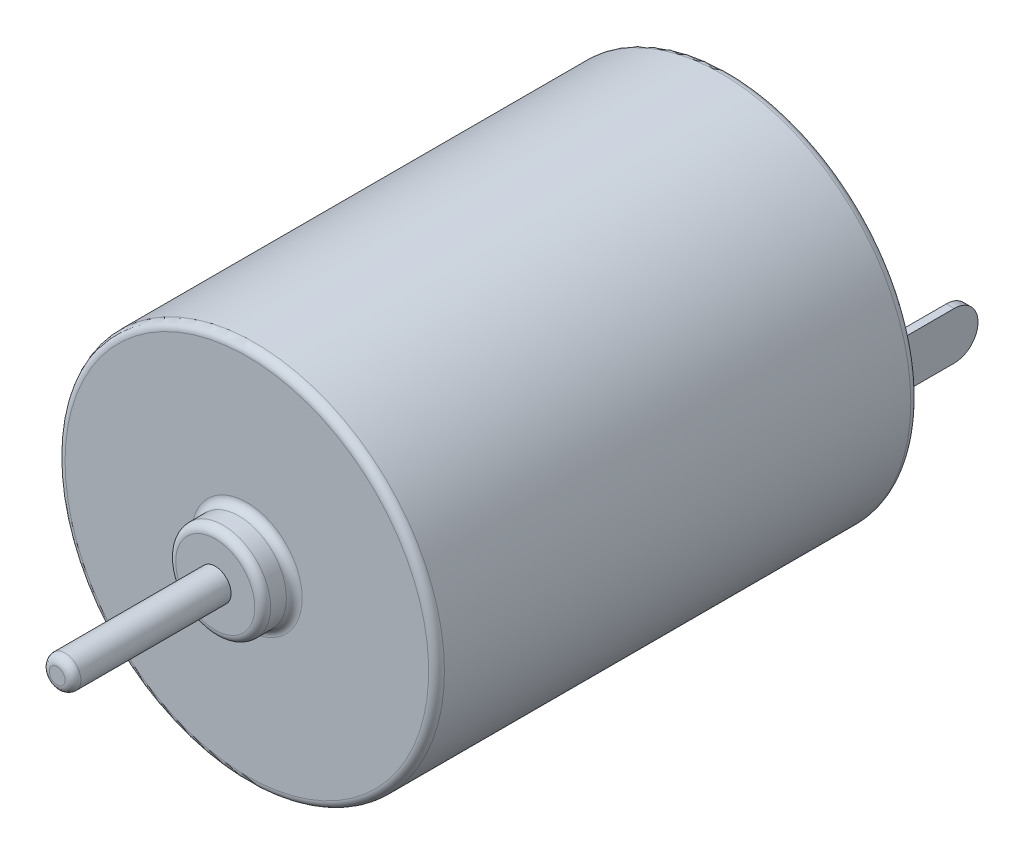
ISO-10303-21;
HEADER;
FILE_DESCRIPTION(('STEP AP214'),'2;1');
FILE_NAME('part.step','',(''),(''),'','','');
FILE_SCHEMA(('AUTOMOTIVE_DESIGN { 1 0 10303 214 1 1 1 1 }'));
ENDSEC;
DATA;
#1=APPLICATION_CONTEXT('core data for automotive mechanical design processes');
#2=APPLICATION_PROTOCOL_DEFINITION('international standard','automotive_design',2000,#1);
#3=PRODUCT_CONTEXT('',#1,'mechanical');
#4=PRODUCT('Part','Part','',(#3));
#5=PRODUCT_RELATED_PRODUCT_CATEGORY('part','',(#4));
#6=PRODUCT_DEFINITION_FORMATION('','',#4);
#7=PRODUCT_DEFINITION_CONTEXT('part definition',#1,'design');
#8=PRODUCT_DEFINITION('design','',#6,#7);
#9=PRODUCT_DEFINITION_SHAPE('','',#8);
#10=(LENGTH_UNIT() NAMED_UNIT(*) SI_UNIT(.MILLI.,.METRE.));
#11=(NAMED_UNIT(*) PLANE_ANGLE_UNIT() SI_UNIT($,.RADIAN.));
#12=(NAMED_UNIT(*) SI_UNIT($,.STERADIAN.) SOLID_ANGLE_UNIT());
#13=UNCERTAINTY_MEASURE_WITH_UNIT(LENGTH_MEASURE(1.E-05),#10,'distance_accuracy_value','');
#14=(GEOMETRIC_REPRESENTATION_CONTEXT(3) GLOBAL_UNCERTAINTY_ASSIGNED_CONTEXT((#13)) GLOBAL_UNIT_ASSIGNED_CONTEXT((#10,
#11,#12)) REPRESENTATION_CONTEXT('',''));
#15=CARTESIAN_POINT('',(0.,0.,0.));
#16=DIRECTION('',(0.,0.,1.));
#17=DIRECTION('',(1.,0.,0.));
#18=AXIS2_PLACEMENT_3D('',#15,#16,#17);
#19=CARTESIAN_POINT('',(9.75,-1.5,0.));
#20=DIRECTION('',(0.,-1.,0.));
#21=DIRECTION('',(0.,0.,-1.));
#22=AXIS2_PLACEMENT_3D('',#19,#20,#21);
#23=PLANE('',#22);
#24=DIRECTION('',(1.,0.,0.));
#25=VECTOR('',#24,1.);
#26=CARTESIAN_POINT('',(4.875,-1.5,-0.5));
#27=LINE('',#26,#25);
#28=CARTESIAN_POINT('',(9.25,-1.5,-0.5));
#29=VERTEX_POINT('',#28);
#30=CARTESIAN_POINT('',(9.75,-1.5,-0.5));
#31=VERTEX_POINT('',#30);
#32=EDGE_CURVE('E337',#29,#31,#27,.T.);
#33=ORIENTED_EDGE('',*,*,#32,.F.);
#34=DIRECTION('',(0.,0.,-1.));
#35=VECTOR('',#34,1.);
#36=CARTESIAN_POINT('',(9.25,-1.5,0.));
#37=LINE('',#36,#35);
#38=CARTESIAN_POINT('',(9.25,-1.5,-4.5));
#39=VERTEX_POINT('',#38);
#40=EDGE_CURVE('E11',#29,#39,#37,.T.);
#41=ORIENTED_EDGE('',*,*,#40,.T.);
#42=DIRECTION('',(-1.,0.,0.));
#43=VECTOR('',#42,1.);
#44=CARTESIAN_POINT('',(9.625,-1.5,-4.5));
#45=LINE('',#44,#43);
#46=CARTESIAN_POINT('',(9.75,-1.5,-4.5));
#47=VERTEX_POINT('',#46);
#48=EDGE_CURVE('E324',#47,#39,#45,.T.);
#49=ORIENTED_EDGE('',*,*,#48,.F.);
#50=DIRECTION('',(0.,0.,-1.));
#51=VECTOR('',#50,1.);
#52=CARTESIAN_POINT('',(9.75,-1.5,0.));
#53=LINE('',#52,#51);
#54=EDGE_CURVE('E238',#31,#47,#53,.T.);
#55=ORIENTED_EDGE('',*,*,#54,.F.);
#56=EDGE_LOOP('',(#33,#41,#49,#55));
#57=FACE_BOUND('',#56,.T.);
#58=ADVANCED_FACE('F17',(#57),#23,.T.);
#59=CARTESIAN_POINT('',(9.25,-1.5,0.));
#60=DIRECTION('',(-1.,0.,0.));
#61=DIRECTION('',(0.,0.,1.));
#62=AXIS2_PLACEMENT_3D('',#59,#60,#61);
#63=PLANE('',#62);
#64=DIRECTION('',(0.,-1.,0.));
#65=VECTOR('',#64,1.);
#66=CARTESIAN_POINT('',(9.25,-0.75,-0.5));
#67=LINE('',#66,#65);
#68=CARTESIAN_POINT('',(9.25,1.5,-0.5));
#69=VERTEX_POINT('',#68);
#70=EDGE_CURVE('E312',#69,#29,#67,.T.);
#71=ORIENTED_EDGE('',*,*,#70,.F.);
#72=DIRECTION('',(0.,0.,-1.));
#73=VECTOR('',#72,1.);
#74=CARTESIAN_POINT('',(9.25,1.5,0.));
#75=LINE('',#74,#73);
#76=CARTESIAN_POINT('',(9.25,1.5,-4.5));
#77=VERTEX_POINT('',#76);
#78=EDGE_CURVE('E251',#69,#77,#75,.T.);
#79=ORIENTED_EDGE('',*,*,#78,.T.);
#80=CARTESIAN_POINT('',(9.25,0.,-4.5));
#81=DIRECTION('',(1.,0.,0.));
#82=DIRECTION('',(0.,0.707106781186547,-0.707106781186548));
#83=AXIS2_PLACEMENT_3D('',#80,#81,#82);
#84=CIRCLE('',#83,1.5);
#85=EDGE_CURVE('E28',#39,#77,#84,.T.);
#86=ORIENTED_EDGE('',*,*,#85,.F.);
#87=ORIENTED_EDGE('',*,*,#40,.F.);
#88=EDGE_LOOP('',(#71,#79,#86,#87));
#89=FACE_BOUND('',#88,.T.);
#90=ADVANCED_FACE('F539',(#89),#63,.T.);
#91=CARTESIAN_POINT('',(-9.25,-1.5,0.));
#92=DIRECTION('',(0.,-1.,0.));
#93=DIRECTION('',(0.,0.,-1.));
#94=AXIS2_PLACEMENT_3D('',#91,#92,#93);
#95=PLANE('',#94);
#96=DIRECTION('',(1.,0.,0.));
#97=VECTOR('',#96,1.);
#98=CARTESIAN_POINT('',(-4.625,-1.5,-0.5));
#99=LINE('',#98,#97);
#100=CARTESIAN_POINT('',(-9.75,-1.5,-0.5));
#101=VERTEX_POINT('',#100);
#102=CARTESIAN_POINT('',(-9.25,-1.5,-0.5));
#103=VERTEX_POINT('',#102);
#104=EDGE_CURVE('E273',#101,#103,#99,.T.);
#105=ORIENTED_EDGE('',*,*,#104,.F.);
#106=DIRECTION('',(0.,0.,-1.));
#107=VECTOR('',#106,1.);
#108=CARTESIAN_POINT('',(-9.75,-1.5,0.));
#109=LINE('',#108,#107);
#110=CARTESIAN_POINT('',(-9.75,-1.5,-4.5));
#111=VERTEX_POINT('',#110);
#112=EDGE_CURVE('E363',#101,#111,#109,.T.);
#113=ORIENTED_EDGE('',*,*,#112,.T.);
#114=DIRECTION('',(-1.,0.,0.));
#115=VECTOR('',#114,1.);
#116=CARTESIAN_POINT('',(-9.375,-1.5,-4.5));
#117=LINE('',#116,#115);
#118=CARTESIAN_POINT('',(-9.25,-1.5,-4.5));
#119=VERTEX_POINT('',#118);
#120=EDGE_CURVE('E427',#119,#111,#117,.T.);
#121=ORIENTED_EDGE('',*,*,#120,.F.);
#122=DIRECTION('',(0.,0.,-1.));
#123=VECTOR('',#122,1.);
#124=CARTESIAN_POINT('',(-9.25,-1.5,0.));
#125=LINE('',#124,#123);
#126=EDGE_CURVE('E268',#103,#119,#125,.T.);
#127=ORIENTED_EDGE('',*,*,#126,.F.);
#128=EDGE_LOOP('',(#105,#113,#121,#127));
#129=FACE_BOUND('',#128,.T.);
#130=ADVANCED_FACE('F479',(#129),#95,.T.);
#131=CARTESIAN_POINT('',(9.375,0.,-4.5));
#132=DIRECTION('',(1.,0.,0.));
#133=DIRECTION('',(0.,0.707106781186547,-0.707106781186548));
#134=AXIS2_PLACEMENT_3D('',#131,#132,#133);
#135=CYLINDRICAL_SURFACE('',#134,1.5);
#136=CARTESIAN_POINT('',(9.75,0.,-4.5));
#137=DIRECTION('',(-1.,0.,0.));
#138=DIRECTION('',(0.,-0.707106781186547,-0.707106781186548));
#139=AXIS2_PLACEMENT_3D('',#136,#137,#138);
#140=CIRCLE('',#139,1.5);
#141=CARTESIAN_POINT('',(9.75,1.5,-4.5));
#142=VERTEX_POINT('',#141);
#143=EDGE_CURVE('E345',#142,#47,#140,.T.);
#144=ORIENTED_EDGE('',*,*,#143,.T.);
#145=ORIENTED_EDGE('',*,*,#48,.T.);
#146=ORIENTED_EDGE('',*,*,#85,.T.);
#147=DIRECTION('',(1.,0.,0.));
#148=VECTOR('',#147,1.);
#149=CARTESIAN_POINT('',(9.375,1.5,-4.5));
#150=LINE('',#149,#148);
#151=EDGE_CURVE('E255',#77,#142,#150,.T.);
#152=ORIENTED_EDGE('',*,*,#151,.T.);
#153=EDGE_LOOP('',(#144,#145,#146,#152));
#154=FACE_BOUND('',#153,.T.);
#155=ADVANCED_FACE('F781',(#154),#135,.T.);
#156=CARTESIAN_POINT('',(-9.625,0.,-4.5));
#157=DIRECTION('',(1.,0.,0.));
#158=DIRECTION('',(0.,0.707106781186547,-0.707106781186548));
#159=AXIS2_PLACEMENT_3D('',#156,#157,#158);
#160=CYLINDRICAL_SURFACE('',#159,1.5);
#161=CARTESIAN_POINT('',(-9.25,0.,-4.5));
#162=DIRECTION('',(-1.,0.,0.));
#163=DIRECTION('',(0.,-0.707106781186547,-0.707106781186548));
#164=AXIS2_PLACEMENT_3D('',#161,#162,#163);
#165=CIRCLE('',#164,1.5);
#166=CARTESIAN_POINT('',(-9.25,1.5,-4.5));
#167=VERTEX_POINT('',#166);
#168=EDGE_CURVE('E385',#167,#119,#165,.T.);
#169=ORIENTED_EDGE('',*,*,#168,.T.);
#170=ORIENTED_EDGE('',*,*,#120,.T.);
#171=CARTESIAN_POINT('',(-9.75,0.,-4.5));
#172=DIRECTION('',(1.,0.,0.));
#173=DIRECTION('',(0.,0.707106781186547,-0.707106781186548));
#174=AXIS2_PLACEMENT_3D('',#171,#172,#173);
#175=CIRCLE('',#174,1.5);
#176=CARTESIAN_POINT('',(-9.75,1.5,-4.5));
#177=VERTEX_POINT('',#176);
#178=EDGE_CURVE('E262',#111,#177,#175,.T.);
#179=ORIENTED_EDGE('',*,*,#178,.T.);
#180=DIRECTION('',(1.,0.,0.));
#181=VECTOR('',#180,1.);
#182=CARTESIAN_POINT('',(-9.625,1.5,-4.5));
#183=LINE('',#182,#181);
#184=EDGE_CURVE('E369',#177,#167,#183,.T.);
#185=ORIENTED_EDGE('',*,*,#184,.T.);
#186=EDGE_LOOP('',(#169,#170,#179,#185));
#187=FACE_BOUND('',#186,.T.);
#188=ADVANCED_FACE('F453',(#187),#160,.T.);
#189=CARTESIAN_POINT('',(-9.25,1.5,0.));
#190=DIRECTION('',(1.,0.,0.));
#191=DIRECTION('',(0.,1.,0.));
#192=AXIS2_PLACEMENT_3D('',#189,#190,#191);
#193=PLANE('',#192);
#194=DIRECTION('',(0.,1.,0.));
#195=VECTOR('',#194,1.);
#196=CARTESIAN_POINT('',(-9.25,0.75,-0.5));
#197=LINE('',#196,#195);
#198=CARTESIAN_POINT('',(-9.25,1.5,-0.5));
#199=VERTEX_POINT('',#198);
#200=EDGE_CURVE('E263',#103,#199,#197,.T.);
#201=ORIENTED_EDGE('',*,*,#200,.F.);
#202=ORIENTED_EDGE('',*,*,#126,.T.);
#203=ORIENTED_EDGE('',*,*,#168,.F.);
#204=DIRECTION('',(0.,0.,-1.));
#205=VECTOR('',#204,1.);
#206=CARTESIAN_POINT('',(-9.25,1.5,0.));
#207=LINE('',#206,#205);
#208=EDGE_CURVE('E382',#199,#167,#207,.T.);
#209=ORIENTED_EDGE('',*,*,#208,.F.);
#210=EDGE_LOOP('',(#201,#202,#203,#209));
#211=FACE_BOUND('',#210,.T.);
#212=ADVANCED_FACE('F460',(#211),#193,.T.);
#213=CARTESIAN_POINT('',(0.,0.,-2.5));
#214=DIRECTION('',(0.,0.,-1.));
#215=DIRECTION('',(0.,-1.,0.));
#216=AXIS2_PLACEMENT_3D('',#213,#214,#215);
#217=PLANE('',#216);
#218=CARTESIAN_POINT('',(0.,0.,-2.5));
#219=DIRECTION('',(0.,0.,1.));
#220=DIRECTION('',(1.,0.,0.));
#221=AXIS2_PLACEMENT_3D('',#218,#219,#220);
#222=CIRCLE('',#221,3.5);
#223=CARTESIAN_POINT('',(3.5,0.,-2.5));
#224=VERTEX_POINT('',#223);
#225=EDGE_CURVE('E249',#224,#224,#222,.T.);
#226=ORIENTED_EDGE('',*,*,#225,.F.);
#227=EDGE_LOOP('',(#226));
#228=FACE_BOUND('',#227,.T.);
#229=ADVANCED_FACE('F695',(#228),#217,.T.);
#230=CARTESIAN_POINT('',(0.,0.,-2.));
#231=DIRECTION('',(0.,0.,-1.));
#232=DIRECTION('',(-1.,0.,0.));
#233=AXIS2_PLACEMENT_3D('',#230,#231,#232);
#234=TOROIDAL_SURFACE('',#233,3.5,0.5);
#235=ORIENTED_EDGE('',*,*,#225,.T.);
#236=CARTESIAN_POINT('',(3.5,0.,-2.));
#237=DIRECTION('',(0.,-1.,0.));
#238=DIRECTION('',(1.,0.,0.));
#239=AXIS2_PLACEMENT_3D('',#236,#237,#238);
#240=CIRCLE('',#239,0.5);
#241=CARTESIAN_POINT('',(4.,0.,-2.));
#242=VERTEX_POINT('',#241);
#243=EDGE_CURVE('E265',#224,#242,#240,.T.);
#244=ORIENTED_EDGE('',*,*,#243,.T.);
#245=CARTESIAN_POINT('',(0.,0.,-2.));
#246=DIRECTION('',(0.,0.,-1.));
#247=DIRECTION('',(1.,0.,0.));
#248=AXIS2_PLACEMENT_3D('',#245,#246,#247);
#249=CIRCLE('',#248,4.);
#250=CARTESIAN_POINT('',(-4.,0.,-2.));
#251=VERTEX_POINT('',#250);
#252=EDGE_CURVE('E246',#242,#251,#249,.T.);
#253=ORIENTED_EDGE('',*,*,#252,.T.);
#254=CARTESIAN_POINT('',(0.,0.,-2.));
#255=DIRECTION('',(0.,0.,-1.));
#256=DIRECTION('',(1.,0.,0.));
#257=AXIS2_PLACEMENT_3D('',#254,#255,#256);
#258=CIRCLE('',#257,4.);
#259=EDGE_CURVE('E423',#251,#242,#258,.T.);
#260=ORIENTED_EDGE('',*,*,#259,.T.);
#261=ORIENTED_EDGE('',*,*,#243,.F.);
#262=EDGE_LOOP('',(#235,#244,#253,#260,#261));
#263=FACE_BOUND('',#262,.T.);
#264=ADVANCED_FACE('F701',(#263),#234,.T.);
#265=CARTESIAN_POINT('',(0.,0.,0.));
#266=DIRECTION('',(0.,0.,-1.));
#267=DIRECTION('',(1.,0.,0.));
#268=AXIS2_PLACEMENT_3D('',#265,#266,#267);
#269=CYLINDRICAL_SURFACE('',#268,4.);
#270=ORIENTED_EDGE('',*,*,#259,.F.);
#271=DIRECTION('',(0.,0.,1.));
#272=VECTOR('',#271,1.);
#273=CARTESIAN_POINT('',(-4.,0.,0.));
#274=LINE('',#273,#272);
#275=CARTESIAN_POINT('',(-4.,0.,-0.5));
#276=VERTEX_POINT('',#275);
#277=EDGE_CURVE('E250',#251,#276,#274,.T.);
#278=ORIENTED_EDGE('',*,*,#277,.T.);
#279=CARTESIAN_POINT('',(0.,0.,-0.5));
#280=DIRECTION('',(0.,0.,1.));
#281=DIRECTION('',(1.,0.,0.));
#282=AXIS2_PLACEMENT_3D('',#279,#280,#281);
#283=CIRCLE('',#282,4.);
#284=EDGE_CURVE('E240',#276,#276,#283,.T.);
#285=ORIENTED_EDGE('',*,*,#284,.F.);
#286=ORIENTED_EDGE('',*,*,#277,.F.);
#287=ORIENTED_EDGE('',*,*,#252,.F.);
#288=EDGE_LOOP('',(#270,#278,#285,#286,#287));
#289=FACE_BOUND('',#288,.T.);
#290=ADVANCED_FACE('F569',(#289),#269,.T.);
#291=CARTESIAN_POINT('',(0.,0.,-0.5));
#292=DIRECTION('',(0.,0.,1.));
#293=DIRECTION('',(1.,0.,0.));
#294=AXIS2_PLACEMENT_3D('',#291,#292,#293);
#295=TOROIDAL_SURFACE('',#294,4.5,0.5);
#296=ORIENTED_EDGE('',*,*,#284,.T.);
#297=CARTESIAN_POINT('',(-4.5,0.,-0.5));
#298=DIRECTION('',(0.,-1.,0.));
#299=DIRECTION('',(-1.,0.,0.));
#300=AXIS2_PLACEMENT_3D('',#297,#298,#299);
#301=CIRCLE('',#300,0.5);
#302=CARTESIAN_POINT('',(-4.5,0.,0.));
#303=VERTEX_POINT('',#302);
#304=EDGE_CURVE('E244',#276,#303,#301,.T.);
#305=ORIENTED_EDGE('',*,*,#304,.T.);
#306=CARTESIAN_POINT('',(0.,0.,0.));
#307=DIRECTION('',(0.,0.,-1.));
#308=DIRECTION('',(1.,0.,0.));
#309=AXIS2_PLACEMENT_3D('',#306,#307,#308);
#310=CIRCLE('',#309,4.5);
#311=EDGE_CURVE('E274',#303,#303,#310,.T.);
#312=ORIENTED_EDGE('',*,*,#311,.T.);
#313=ORIENTED_EDGE('',*,*,#304,.F.);
#314=EDGE_LOOP('',(#296,#305,#312,#313));
#315=FACE_BOUND('',#314,.T.);
#316=ADVANCED_FACE('F559',(#315),#295,.F.);
#317=CARTESIAN_POINT('',(0.,0.,0.5));
#318=DIRECTION('',(0.,0.,1.));
#319=DIRECTION('',(1.,0.,0.));
#320=AXIS2_PLACEMENT_3D('',#317,#318,#319);
#321=TOROIDAL_SURFACE('',#320,11.5,0.5);
#322=CARTESIAN_POINT('',(0.,0.,0.5));
#323=DIRECTION('',(0.,0.,-1.));
#324=DIRECTION('',(1.,0.,0.));
#325=AXIS2_PLACEMENT_3D('',#322,#323,#324);
#326=CIRCLE('',#325,12.);
#327=CARTESIAN_POINT('',(-12.,0.,0.5));
#328=VERTEX_POINT('',#327);
#329=EDGE_CURVE('E294',#328,#328,#326,.T.);
#330=ORIENTED_EDGE('',*,*,#329,.T.);
#331=CARTESIAN_POINT('',(-11.5,0.,0.5));
#332=DIRECTION('',(0.,-1.,0.));
#333=DIRECTION('',(-1.,0.,0.));
#334=AXIS2_PLACEMENT_3D('',#331,#332,#333);
#335=CIRCLE('',#334,0.5);
#336=CARTESIAN_POINT('',(-11.5,0.,0.));
#337=VERTEX_POINT('',#336);
#338=EDGE_CURVE('E245',#328,#337,#335,.T.);
#339=ORIENTED_EDGE('',*,*,#338,.T.);
#340=CARTESIAN_POINT('',(0.,0.,0.));
#341=DIRECTION('',(0.,0.,1.));
#342=DIRECTION('',(1.,0.,0.));
#343=AXIS2_PLACEMENT_3D('',#340,#341,#342);
#344=CIRCLE('',#343,11.5);
#345=EDGE_CURVE('E349',#337,#337,#344,.T.);
#346=ORIENTED_EDGE('',*,*,#345,.T.);
#347=ORIENTED_EDGE('',*,*,#338,.F.);
#348=EDGE_LOOP('',(#330,#339,#346,#347));
#349=FACE_BOUND('',#348,.T.);
#350=ADVANCED_FACE('F551',(#349),#321,.T.);
#351=CARTESIAN_POINT('',(0.,0.,32.5));
#352=DIRECTION('',(0.,0.,1.));
#353=DIRECTION('',(1.,0.,0.));
#354=AXIS2_PLACEMENT_3D('',#351,#352,#353);
#355=PLANE('',#354);
#356=CARTESIAN_POINT('',(0.,0.,32.5));
#357=DIRECTION('',(0.,0.,-1.));
#358=DIRECTION('',(-1.,0.,0.));
#359=AXIS2_PLACEMENT_3D('',#356,#357,#358);
#360=CIRCLE('',#359,1.);
#361=CARTESIAN_POINT('',(1.,0.,32.5));
#362=VERTEX_POINT('',#361);
#363=EDGE_CURVE('E258',#362,#362,#360,.T.);
#364=ORIENTED_EDGE('',*,*,#363,.T.);
#365=EDGE_LOOP('',(#364));
#366=FACE_BOUND('',#365,.T.);
#367=CARTESIAN_POINT('',(0.,0.,32.5));
#368=DIRECTION('',(0.,0.,-1.));
#369=DIRECTION('',(-1.,0.,0.));
#370=AXIS2_PLACEMENT_3D('',#367,#368,#369);
#371=CIRCLE('',#370,2.5);
#372=CARTESIAN_POINT('',(-2.5,0.,32.5));
#373=VERTEX_POINT('',#372);
#374=EDGE_CURVE('E283',#373,#373,#371,.T.);
#375=ORIENTED_EDGE('',*,*,#374,.F.);
#376=EDGE_LOOP('',(#375));
#377=FACE_BOUND('',#376,.T.);
#378=ADVANCED_FACE('F558',(#366,#377),#355,.T.);
#379=CARTESIAN_POINT('',(0.,0.,32.));
#380=DIRECTION('',(0.,0.,1.));
#381=DIRECTION('',(1.,0.,0.));
#382=AXIS2_PLACEMENT_3D('',#379,#380,#381);
#383=TOROIDAL_SURFACE('',#382,2.5,0.5);
#384=ORIENTED_EDGE('',*,*,#374,.T.);
#385=CARTESIAN_POINT('',(-2.5,0.,32.));
#386=DIRECTION('',(0.,-1.,0.));
#387=DIRECTION('',(-1.,0.,0.));
#388=AXIS2_PLACEMENT_3D('',#385,#386,#387);
#389=CIRCLE('',#388,0.5);
#390=CARTESIAN_POINT('',(-3.,0.,32.));
#391=VERTEX_POINT('',#390);
#392=EDGE_CURVE('E280',#373,#391,#389,.T.);
#393=ORIENTED_EDGE('',*,*,#392,.T.);
#394=CARTESIAN_POINT('',(0.,0.,32.));
#395=DIRECTION('',(0.,0.,1.));
#396=DIRECTION('',(-1.,0.,0.));
#397=AXIS2_PLACEMENT_3D('',#394,#395,#396);
#398=CIRCLE('',#397,3.);
#399=CARTESIAN_POINT('',(3.,0.,32.));
#400=VERTEX_POINT('',#399);
#401=EDGE_CURVE('E21',#391,#400,#398,.T.);
#402=ORIENTED_EDGE('',*,*,#401,.T.);
#403=CARTESIAN_POINT('',(0.,0.,32.));
#404=DIRECTION('',(0.,0.,1.));
#405=DIRECTION('',(-1.,0.,0.));
#406=AXIS2_PLACEMENT_3D('',#403,#404,#405);
#407=CIRCLE('',#406,3.);
#408=EDGE_CURVE('E397',#400,#391,#407,.T.);
#409=ORIENTED_EDGE('',*,*,#408,.T.);
#410=ORIENTED_EDGE('',*,*,#392,.F.);
#411=EDGE_LOOP('',(#384,#393,#402,#409,#410));
#412=FACE_BOUND('',#411,.T.);
#413=ADVANCED_FACE('F566',(#412),#383,.T.);
#414=CARTESIAN_POINT('',(0.,0.,30.5));
#415=DIRECTION('',(0.,0.,1.));
#416=DIRECTION('',(-1.,0.,0.));
#417=AXIS2_PLACEMENT_3D('',#414,#415,#416);
#418=CYLINDRICAL_SURFACE('',#417,3.);
#419=ORIENTED_EDGE('',*,*,#408,.F.);
#420=DIRECTION('',(0.,0.,-1.));
#421=VECTOR('',#420,1.);
#422=CARTESIAN_POINT('',(3.,0.,30.5));
#423=LINE('',#422,#421);
#424=CARTESIAN_POINT('',(3.,0.,31.));
#425=VERTEX_POINT('',#424);
#426=EDGE_CURVE('E401',#400,#425,#423,.T.);
#427=ORIENTED_EDGE('',*,*,#426,.T.);
#428=CARTESIAN_POINT('',(0.,0.,31.));
#429=DIRECTION('',(0.,0.,-1.));
#430=DIRECTION('',(-1.,0.,0.));
#431=AXIS2_PLACEMENT_3D('',#428,#429,#430);
#432=CIRCLE('',#431,3.);
#433=EDGE_CURVE('E289',#425,#425,#432,.T.);
#434=ORIENTED_EDGE('',*,*,#433,.F.);
#435=ORIENTED_EDGE('',*,*,#426,.F.);
#436=ORIENTED_EDGE('',*,*,#401,.F.);
#437=EDGE_LOOP('',(#419,#427,#434,#435,#436));
#438=FACE_BOUND('',#437,.T.);
#439=ADVANCED_FACE('F722',(#438),#418,.T.);
#440=CARTESIAN_POINT('',(0.,0.,31.));
#441=DIRECTION('',(0.,0.,-1.));
#442=DIRECTION('',(-1.,0.,0.));
#443=AXIS2_PLACEMENT_3D('',#440,#441,#442);
#444=TOROIDAL_SURFACE('',#443,3.5,0.5);
#445=ORIENTED_EDGE('',*,*,#433,.T.);
#446=CARTESIAN_POINT('',(3.5,0.,31.));
#447=DIRECTION('',(0.,-1.,0.));
#448=DIRECTION('',(1.,0.,0.));
#449=AXIS2_PLACEMENT_3D('',#446,#447,#448);
#450=CIRCLE('',#449,0.5);
#451=CARTESIAN_POINT('',(3.5,0.,30.5));
#452=VERTEX_POINT('',#451);
#453=EDGE_CURVE('E293',#425,#452,#450,.T.);
#454=ORIENTED_EDGE('',*,*,#453,.T.);
#455=CARTESIAN_POINT('',(0.,0.,30.5));
#456=DIRECTION('',(0.,0.,1.));
#457=DIRECTION('',(-1.,0.,0.));
#458=AXIS2_PLACEMENT_3D('',#455,#456,#457);
#459=CIRCLE('',#458,3.5);
#460=EDGE_CURVE('E298',#452,#452,#459,.T.);
#461=ORIENTED_EDGE('',*,*,#460,.T.);
#462=ORIENTED_EDGE('',*,*,#453,.F.);
#463=EDGE_LOOP('',(#445,#454,#461,#462));
#464=FACE_BOUND('',#463,.T.);
#465=ADVANCED_FACE('F532',(#464),#444,.F.);
#466=CARTESIAN_POINT('',(0.,0.,0.));
#467=DIRECTION('',(0.,0.,1.));
#468=DIRECTION('',(1.,0.,0.));
#469=AXIS2_PLACEMENT_3D('',#466,#467,#468);
#470=CYLINDRICAL_SURFACE('',#469,12.);
#471=CARTESIAN_POINT('',(0.,0.,30.));
#472=DIRECTION('',(0.,0.,1.));
#473=DIRECTION('',(1.,0.,0.));
#474=AXIS2_PLACEMENT_3D('',#471,#472,#473);
#475=CIRCLE('',#474,12.);
#476=CARTESIAN_POINT('',(-12.,0.,30.));
#477=VERTEX_POINT('',#476);
#478=EDGE_CURVE('E412',#477,#477,#475,.T.);
#479=ORIENTED_EDGE('',*,*,#478,.F.);
#480=DIRECTION('',(0.,0.,-1.));
#481=VECTOR('',#480,1.);
#482=CARTESIAN_POINT('',(-12.,0.,0.));
#483=LINE('',#482,#481);
#484=EDGE_CURVE('E295',#477,#328,#483,.T.);
#485=ORIENTED_EDGE('',*,*,#484,.T.);
#486=ORIENTED_EDGE('',*,*,#329,.F.);
#487=ORIENTED_EDGE('',*,*,#484,.F.);
#488=EDGE_LOOP('',(#479,#485,#486,#487));
#489=FACE_BOUND('',#488,.T.);
#490=ADVANCED_FACE('F522',(#489),#470,.T.);
#491=CARTESIAN_POINT('',(0.,0.,30.5));
#492=DIRECTION('',(0.,0.,1.));
#493=DIRECTION('',(1.,0.,0.));
#494=AXIS2_PLACEMENT_3D('',#491,#492,#493);
#495=PLANE('',#494);
#496=ORIENTED_EDGE('',*,*,#460,.F.);
#497=EDGE_LOOP('',(#496));
#498=FACE_BOUND('',#497,.T.);
#499=CARTESIAN_POINT('',(0.,0.,30.5));
#500=DIRECTION('',(0.,0.,-1.));
#501=DIRECTION('',(1.,0.,0.));
#502=AXIS2_PLACEMENT_3D('',#499,#500,#501);
#503=CIRCLE('',#502,11.5);
#504=CARTESIAN_POINT('',(-11.5,0.,30.5));
#505=VERTEX_POINT('',#504);
#506=EDGE_CURVE('E364',#505,#505,#503,.T.);
#507=ORIENTED_EDGE('',*,*,#506,.F.);
#508=EDGE_LOOP('',(#507));
#509=FACE_BOUND('',#508,.T.);
#510=ADVANCED_FACE('F520',(#498,#509),#495,.T.);
#511=CARTESIAN_POINT('',(0.,0.,30.));
#512=DIRECTION('',(0.,0.,1.));
#513=DIRECTION('',(1.,0.,0.));
#514=AXIS2_PLACEMENT_3D('',#511,#512,#513);
#515=TOROIDAL_SURFACE('',#514,11.5,0.5);
#516=ORIENTED_EDGE('',*,*,#506,.T.);
#517=CARTESIAN_POINT('',(-11.5,0.,30.));
#518=DIRECTION('',(0.,-1.,0.));
#519=DIRECTION('',(-1.,0.,0.));
#520=AXIS2_PLACEMENT_3D('',#517,#518,#519);
#521=CIRCLE('',#520,0.5);
#522=EDGE_CURVE('E368',#505,#477,#521,.T.);
#523=ORIENTED_EDGE('',*,*,#522,.T.);
#524=ORIENTED_EDGE('',*,*,#478,.T.);
#525=ORIENTED_EDGE('',*,*,#522,.F.);
#526=EDGE_LOOP('',(#516,#523,#524,#525));
#527=FACE_BOUND('',#526,.T.);
#528=ADVANCED_FACE('F516',(#527),#515,.T.);
#529=CARTESIAN_POINT('',(-9.75,1.5,0.));
#530=DIRECTION('',(0.,1.,0.));
#531=DIRECTION('',(1.,0.,0.));
#532=AXIS2_PLACEMENT_3D('',#529,#530,#531);
#533=PLANE('',#532);
#534=DIRECTION('',(-1.,0.,0.));
#535=VECTOR('',#534,1.);
#536=CARTESIAN_POINT('',(-4.875,1.5,-0.5));
#537=LINE('',#536,#535);
#538=CARTESIAN_POINT('',(-9.75,1.5,-0.5));
#539=VERTEX_POINT('',#538);
#540=EDGE_CURVE('E272',#199,#539,#537,.T.);
#541=ORIENTED_EDGE('',*,*,#540,.F.);
#542=ORIENTED_EDGE('',*,*,#208,.T.);
#543=ORIENTED_EDGE('',*,*,#184,.F.);
#544=DIRECTION('',(0.,0.,-1.));
#545=VECTOR('',#544,1.);
#546=CARTESIAN_POINT('',(-9.75,1.5,0.));
#547=LINE('',#546,#545);
#548=EDGE_CURVE('E259',#539,#177,#547,.T.);
#549=ORIENTED_EDGE('',*,*,#548,.F.);
#550=EDGE_LOOP('',(#541,#542,#543,#549));
#551=FACE_BOUND('',#550,.T.);
#552=ADVANCED_FACE('F457',(#551),#533,.T.);
#553=CARTESIAN_POINT('',(-9.75,-1.5,0.));
#554=DIRECTION('',(-1.,0.,0.));
#555=DIRECTION('',(0.,0.,1.));
#556=AXIS2_PLACEMENT_3D('',#553,#554,#555);
#557=PLANE('',#556);
#558=DIRECTION('',(0.,-1.,0.));
#559=VECTOR('',#558,1.);
#560=CARTESIAN_POINT('',(-9.75,-0.75,-0.5));
#561=LINE('',#560,#559);
#562=EDGE_CURVE('E370',#539,#101,#561,.T.);
#563=ORIENTED_EDGE('',*,*,#562,.F.);
#564=ORIENTED_EDGE('',*,*,#548,.T.);
#565=ORIENTED_EDGE('',*,*,#178,.F.);
#566=ORIENTED_EDGE('',*,*,#112,.F.);
#567=EDGE_LOOP('',(#563,#564,#565,#566));
#568=FACE_BOUND('',#567,.T.);
#569=ADVANCED_FACE('F482',(#568),#557,.T.);
#570=CARTESIAN_POINT('',(-8.75,0.75,-0.5));
#571=DIRECTION('',(0.,1.,0.));
#572=DIRECTION('',(-0.707106781186548,0.,0.707106781186547));
#573=AXIS2_PLACEMENT_3D('',#570,#571,#572);
#574=CYLINDRICAL_SURFACE('',#573,0.5);
#575=DIRECTION('',(0.,-1.,0.));
#576=VECTOR('',#575,1.);
#577=CARTESIAN_POINT('',(-8.75,0.75,0.));
#578=LINE('',#577,#576);
#579=CARTESIAN_POINT('',(-8.75,2.,0.));
#580=VERTEX_POINT('',#579);
#581=CARTESIAN_POINT('',(-8.75,-2.,0.));
#582=VERTEX_POINT('',#581);
#583=EDGE_CURVE('E279',#580,#582,#578,.T.);
#584=ORIENTED_EDGE('',*,*,#583,.T.);
#585=CARTESIAN_POINT('',(-8.75,-2.,-0.5));
#586=DIRECTION('',(0.707106781186547,0.707106781186548,0.));
#587=DIRECTION('',(-0.707106781186548,0.707106781186547,0.));
#588=AXIS2_PLACEMENT_3D('',#585,#586,#587);
#589=ELLIPSE('',#588,0.707106781186548,0.5);
#590=EDGE_CURVE('E269',#103,#582,#589,.T.);
#591=ORIENTED_EDGE('',*,*,#590,.F.);
#592=ORIENTED_EDGE('',*,*,#200,.T.);
#593=CARTESIAN_POINT('',(-8.75,2.,-0.5));
#594=DIRECTION('',(-0.707106781186547,0.707106781186548,0.));
#595=DIRECTION('',(-0.707106781186548,-0.707106781186547,0.));
#596=AXIS2_PLACEMENT_3D('',#593,#594,#595);
#597=ELLIPSE('',#596,0.707106781186547,0.5);
#598=EDGE_CURVE('E374',#199,#580,#597,.T.);
#599=ORIENTED_EDGE('',*,*,#598,.T.);
#600=EDGE_LOOP('',(#584,#591,#592,#599));
#601=FACE_BOUND('',#600,.T.);
#602=ADVANCED_FACE('F464',(#601),#574,.F.);
#603=CARTESIAN_POINT('',(-10.25,-0.75,-0.5));
#604=DIRECTION('',(0.,-1.,0.));
#605=DIRECTION('',(0.707106781186549,0.,0.707106781186546));
#606=AXIS2_PLACEMENT_3D('',#603,#604,#605);
#607=CYLINDRICAL_SURFACE('',#606,0.5);
#608=DIRECTION('',(0.,1.,0.));
#609=VECTOR('',#608,1.);
#610=CARTESIAN_POINT('',(-10.25,-0.75,0.));
#611=LINE('',#610,#609);
#612=CARTESIAN_POINT('',(-10.25,-2.,0.));
#613=VERTEX_POINT('',#612);
#614=CARTESIAN_POINT('',(-10.25,2.,0.));
#615=VERTEX_POINT('',#614);
#616=EDGE_CURVE('E359',#613,#615,#611,.T.);
#617=ORIENTED_EDGE('',*,*,#616,.T.);
#618=CARTESIAN_POINT('',(-10.25,2.,-0.5));
#619=DIRECTION('',(-0.707106781186547,-0.707106781186548,0.));
#620=DIRECTION('',(0.707106781186548,-0.707106781186547,0.));
#621=AXIS2_PLACEMENT_3D('',#618,#619,#620);
#622=ELLIPSE('',#621,0.707106781186548,0.5);
#623=EDGE_CURVE('E341',#539,#615,#622,.T.);
#624=ORIENTED_EDGE('',*,*,#623,.F.);
#625=ORIENTED_EDGE('',*,*,#562,.T.);
#626=CARTESIAN_POINT('',(-10.25,-2.,-0.5));
#627=DIRECTION('',(-0.707106781186547,0.707106781186548,0.));
#628=DIRECTION('',(-0.707106781186548,-0.707106781186547,0.));
#629=AXIS2_PLACEMENT_3D('',#626,#627,#628);
#630=ELLIPSE('',#629,0.707106781186548,0.5);
#631=EDGE_CURVE('E278',#613,#101,#630,.T.);
#632=ORIENTED_EDGE('',*,*,#631,.F.);
#633=EDGE_LOOP('',(#617,#624,#625,#632));
#634=FACE_BOUND('',#633,.T.);
#635=ADVANCED_FACE('F484',(#634),#607,.F.);
#636=CARTESIAN_POINT('',(-4.875,2.,-0.5));
#637=DIRECTION('',(-1.,0.,0.));
#638=DIRECTION('',(0.,-0.707106781186548,0.707106781186547));
#639=AXIS2_PLACEMENT_3D('',#636,#637,#638);
#640=CYLINDRICAL_SURFACE('',#639,0.5);
#641=ORIENTED_EDGE('',*,*,#540,.T.);
#642=ORIENTED_EDGE('',*,*,#623,.T.);
#643=DIRECTION('',(1.,0.,0.));
#644=VECTOR('',#643,1.);
#645=CARTESIAN_POINT('',(-4.875,2.,0.));
#646=LINE('',#645,#644);
#647=EDGE_CURVE('E355',#615,#580,#646,.T.);
#648=ORIENTED_EDGE('',*,*,#647,.T.);
#649=ORIENTED_EDGE('',*,*,#598,.F.);
#650=EDGE_LOOP('',(#641,#642,#648,#649));
#651=FACE_BOUND('',#650,.T.);
#652=ADVANCED_FACE('F467',(#651),#640,.F.);
#653=CARTESIAN_POINT('',(-4.625,-2.,-0.5));
#654=DIRECTION('',(1.,0.,0.));
#655=DIRECTION('',(0.,0.707106781186548,0.707106781186547));
#656=AXIS2_PLACEMENT_3D('',#653,#654,#655);
#657=CYLINDRICAL_SURFACE('',#656,0.5);
#658=DIRECTION('',(-1.,0.,0.));
#659=VECTOR('',#658,1.);
#660=CARTESIAN_POINT('',(-4.625,-2.,0.));
#661=LINE('',#660,#659);
#662=EDGE_CURVE('E329',#582,#613,#661,.T.);
#663=ORIENTED_EDGE('',*,*,#662,.T.);
#664=ORIENTED_EDGE('',*,*,#631,.T.);
#665=ORIENTED_EDGE('',*,*,#104,.T.);
#666=ORIENTED_EDGE('',*,*,#590,.T.);
#667=EDGE_LOOP('',(#663,#664,#665,#666));
#668=FACE_BOUND('',#667,.T.);
#669=ADVANCED_FACE('F19',(#668),#657,.F.);
#670=CARTESIAN_POINT('',(0.,0.,0.));
#671=DIRECTION('',(0.,0.,1.));
#672=DIRECTION('',(1.,0.,0.));
#673=AXIS2_PLACEMENT_3D('',#670,#671,#672);
#674=PLANE('',#673);
#675=DIRECTION('',(0.,-1.,0.));
#676=VECTOR('',#675,1.);
#677=CARTESIAN_POINT('',(10.25,0.75,0.));
#678=LINE('',#677,#676);
#679=CARTESIAN_POINT('',(10.25,2.,0.));
#680=VERTEX_POINT('',#679);
#681=CARTESIAN_POINT('',(10.25,-2.,0.));
#682=VERTEX_POINT('',#681);
#683=EDGE_CURVE('E284',#680,#682,#678,.T.);
#684=ORIENTED_EDGE('',*,*,#683,.F.);
#685=DIRECTION('',(1.,0.,0.));
#686=VECTOR('',#685,1.);
#687=CARTESIAN_POINT('',(4.625,2.,0.));
#688=LINE('',#687,#686);
#689=CARTESIAN_POINT('',(8.75,2.,0.));
#690=VERTEX_POINT('',#689);
#691=EDGE_CURVE('E314',#690,#680,#688,.T.);
#692=ORIENTED_EDGE('',*,*,#691,.F.);
#693=DIRECTION('',(0.,1.,0.));
#694=VECTOR('',#693,1.);
#695=CARTESIAN_POINT('',(8.75,-0.75,0.));
#696=LINE('',#695,#694);
#697=CARTESIAN_POINT('',(8.75,-2.,0.));
#698=VERTEX_POINT('',#697);
#699=EDGE_CURVE('E302',#698,#690,#696,.T.);
#700=ORIENTED_EDGE('',*,*,#699,.F.);
#701=DIRECTION('',(-1.,0.,0.));
#702=VECTOR('',#701,1.);
#703=CARTESIAN_POINT('',(4.875,-2.,0.));
#704=LINE('',#703,#702);
#705=EDGE_CURVE('E333',#682,#698,#704,.T.);
#706=ORIENTED_EDGE('',*,*,#705,.F.);
#707=EDGE_LOOP('',(#684,#692,#700,#706));
#708=FACE_BOUND('',#707,.T.);
#709=ORIENTED_EDGE('',*,*,#311,.F.);
#710=EDGE_LOOP('',(#709));
#711=FACE_BOUND('',#710,.T.);
#712=ORIENTED_EDGE('',*,*,#647,.F.);
#713=ORIENTED_EDGE('',*,*,#616,.F.);
#714=ORIENTED_EDGE('',*,*,#662,.F.);
#715=ORIENTED_EDGE('',*,*,#583,.F.);
#716=EDGE_LOOP('',(#712,#713,#714,#715));
#717=FACE_BOUND('',#716,.T.);
#718=ORIENTED_EDGE('',*,*,#345,.F.);
#719=EDGE_LOOP('',(#718));
#720=FACE_BOUND('',#719,.T.);
#721=ADVANCED_FACE('F472',(#708,#711,#717,#720),#674,.F.);
#722=CARTESIAN_POINT('',(9.75,1.5,0.));
#723=DIRECTION('',(1.,0.,0.));
#724=DIRECTION('',(0.,1.,0.));
#725=AXIS2_PLACEMENT_3D('',#722,#723,#724);
#726=PLANE('',#725);
#727=DIRECTION('',(0.,1.,0.));
#728=VECTOR('',#727,1.);
#729=CARTESIAN_POINT('',(9.75,0.75,-0.5));
#730=LINE('',#729,#728);
#731=CARTESIAN_POINT('',(9.75,1.5,-0.5));
#732=VERTEX_POINT('',#731);
#733=EDGE_CURVE('E392',#31,#732,#730,.T.);
#734=ORIENTED_EDGE('',*,*,#733,.F.);
#735=ORIENTED_EDGE('',*,*,#54,.T.);
#736=ORIENTED_EDGE('',*,*,#143,.F.);
#737=DIRECTION('',(0.,0.,-1.));
#738=VECTOR('',#737,1.);
#739=CARTESIAN_POINT('',(9.75,1.5,0.));
#740=LINE('',#739,#738);
#741=EDGE_CURVE('E170',#732,#142,#740,.T.);
#742=ORIENTED_EDGE('',*,*,#741,.F.);
#743=EDGE_LOOP('',(#734,#735,#736,#742));
#744=FACE_BOUND('',#743,.T.);
#745=ADVANCED_FACE('F740',(#744),#726,.T.);
#746=CARTESIAN_POINT('',(9.25,1.5,0.));
#747=DIRECTION('',(0.,1.,0.));
#748=DIRECTION('',(1.,0.,0.));
#749=AXIS2_PLACEMENT_3D('',#746,#747,#748);
#750=PLANE('',#749);
#751=DIRECTION('',(-1.,0.,0.));
#752=VECTOR('',#751,1.);
#753=CARTESIAN_POINT('',(4.625,1.5,-0.5));
#754=LINE('',#753,#752);
#755=EDGE_CURVE('E303',#732,#69,#754,.T.);
#756=ORIENTED_EDGE('',*,*,#755,.F.);
#757=ORIENTED_EDGE('',*,*,#741,.T.);
#758=ORIENTED_EDGE('',*,*,#151,.F.);
#759=ORIENTED_EDGE('',*,*,#78,.F.);
#760=EDGE_LOOP('',(#756,#757,#758,#759));
#761=FACE_BOUND('',#760,.T.);
#762=ADVANCED_FACE('F735',(#761),#750,.T.);
#763=CARTESIAN_POINT('',(8.75,-0.75,-0.5));
#764=DIRECTION('',(0.,-1.,0.));
#765=DIRECTION('',(0.707106781186548,0.,0.707106781186547));
#766=AXIS2_PLACEMENT_3D('',#763,#764,#765);
#767=CYLINDRICAL_SURFACE('',#766,0.5);
#768=ORIENTED_EDGE('',*,*,#699,.T.);
#769=CARTESIAN_POINT('',(8.75,2.,-0.5));
#770=DIRECTION('',(-0.707106781186547,-0.707106781186548,0.));
#771=DIRECTION('',(0.707106781186548,-0.707106781186547,0.));
#772=AXIS2_PLACEMENT_3D('',#769,#770,#771);
#773=ELLIPSE('',#772,0.707106781186548,0.5);
#774=EDGE_CURVE('E299',#69,#690,#773,.T.);
#775=ORIENTED_EDGE('',*,*,#774,.F.);
#776=ORIENTED_EDGE('',*,*,#70,.T.);
#777=CARTESIAN_POINT('',(8.75,-2.,-0.5));
#778=DIRECTION('',(0.707106781186547,-0.707106781186548,0.));
#779=DIRECTION('',(0.707106781186548,0.707106781186547,0.));
#780=AXIS2_PLACEMENT_3D('',#777,#778,#779);
#781=ELLIPSE('',#780,0.707106781186547,0.5);
#782=EDGE_CURVE('E320',#29,#698,#781,.T.);
#783=ORIENTED_EDGE('',*,*,#782,.T.);
#784=EDGE_LOOP('',(#768,#775,#776,#783));
#785=FACE_BOUND('',#784,.T.);
#786=ADVANCED_FACE('F739',(#785),#767,.F.);
#787=CARTESIAN_POINT('',(4.625,2.,-0.5));
#788=DIRECTION('',(-1.,0.,0.));
#789=DIRECTION('',(0.,-0.707106781186548,0.707106781186547));
#790=AXIS2_PLACEMENT_3D('',#787,#788,#789);
#791=CYLINDRICAL_SURFACE('',#790,0.5);
#792=ORIENTED_EDGE('',*,*,#691,.T.);
#793=CARTESIAN_POINT('',(10.25,2.,-0.5));
#794=DIRECTION('',(-0.707106781186547,0.707106781186548,0.));
#795=DIRECTION('',(-0.707106781186548,-0.707106781186547,0.));
#796=AXIS2_PLACEMENT_3D('',#793,#794,#795);
#797=ELLIPSE('',#796,0.707106781186547,0.5);
#798=EDGE_CURVE('E416',#732,#680,#797,.T.);
#799=ORIENTED_EDGE('',*,*,#798,.F.);
#800=ORIENTED_EDGE('',*,*,#755,.T.);
#801=ORIENTED_EDGE('',*,*,#774,.T.);
#802=EDGE_LOOP('',(#792,#799,#800,#801));
#803=FACE_BOUND('',#802,.T.);
#804=ADVANCED_FACE('F806',(#803),#791,.F.);
#805=CARTESIAN_POINT('',(4.875,-2.,-0.5));
#806=DIRECTION('',(1.,0.,0.));
#807=DIRECTION('',(0.,0.707106781186548,0.707106781186547));
#808=AXIS2_PLACEMENT_3D('',#805,#806,#807);
#809=CYLINDRICAL_SURFACE('',#808,0.5);
#810=ORIENTED_EDGE('',*,*,#32,.T.);
#811=CARTESIAN_POINT('',(10.25,-2.,-0.5));
#812=DIRECTION('',(-0.707106781186547,-0.707106781186548,0.));
#813=DIRECTION('',(0.707106781186548,-0.707106781186547,0.));
#814=AXIS2_PLACEMENT_3D('',#811,#812,#813);
#815=ELLIPSE('',#814,0.707106781186547,0.5);
#816=EDGE_CURVE('E288',#682,#31,#815,.T.);
#817=ORIENTED_EDGE('',*,*,#816,.F.);
#818=ORIENTED_EDGE('',*,*,#705,.T.);
#819=ORIENTED_EDGE('',*,*,#782,.F.);
#820=EDGE_LOOP('',(#810,#817,#818,#819));
#821=FACE_BOUND('',#820,.T.);
#822=ADVANCED_FACE('F855',(#821),#809,.F.);
#823=CARTESIAN_POINT('',(10.25,0.75,-0.5));
#824=DIRECTION('',(0.,1.,0.));
#825=DIRECTION('',(-0.707106781186549,0.,0.707106781186546));
#826=AXIS2_PLACEMENT_3D('',#823,#824,#825);
#827=CYLINDRICAL_SURFACE('',#826,0.5);
#828=ORIENTED_EDGE('',*,*,#683,.T.);
#829=ORIENTED_EDGE('',*,*,#816,.T.);
#830=ORIENTED_EDGE('',*,*,#733,.T.);
#831=ORIENTED_EDGE('',*,*,#798,.T.);
#832=EDGE_LOOP('',(#828,#829,#830,#831));
#833=FACE_BOUND('',#832,.T.);
#834=ADVANCED_FACE('F859',(#833),#827,.F.);
#835=CARTESIAN_POINT('',(0.,0.,42.5));
#836=DIRECTION('',(0.,0.,1.));
#837=DIRECTION('',(1.,0.,0.));
#838=AXIS2_PLACEMENT_3D('',#835,#836,#837);
#839=PLANE('',#838);
#840=CARTESIAN_POINT('',(0.,0.,42.5));
#841=DIRECTION('',(0.,0.,-1.));
#842=DIRECTION('',(-1.,0.,0.));
#843=AXIS2_PLACEMENT_3D('',#840,#841,#842);
#844=CIRCLE('',#843,0.5);
#845=CARTESIAN_POINT('',(-0.5,0.,42.5));
#846=VERTEX_POINT('',#845);
#847=EDGE_CURVE('E228',#846,#846,#844,.T.);
#848=ORIENTED_EDGE('',*,*,#847,.F.);
#849=EDGE_LOOP('',(#848));
#850=FACE_BOUND('',#849,.T.);
#851=ADVANCED_FACE('F765',(#850),#839,.T.);
#852=CARTESIAN_POINT('',(0.,0.,30.5));
#853=DIRECTION('',(0.,0.,1.));
#854=DIRECTION('',(-1.,0.,0.));
#855=AXIS2_PLACEMENT_3D('',#852,#853,#854);
#856=CYLINDRICAL_SURFACE('',#855,1.);
#857=CARTESIAN_POINT('',(0.,0.,42.));
#858=DIRECTION('',(0.,0.,1.));
#859=DIRECTION('',(-1.,0.,0.));
#860=AXIS2_PLACEMENT_3D('',#857,#858,#859);
#861=CIRCLE('',#860,1.);
#862=CARTESIAN_POINT('',(1.,0.,42.));
#863=VERTEX_POINT('',#862);
#864=CARTESIAN_POINT('',(-1.,0.,42.));
#865=VERTEX_POINT('',#864);
#866=EDGE_CURVE('E211',#863,#865,#861,.T.);
#867=ORIENTED_EDGE('',*,*,#866,.F.);
#868=DIRECTION('',(0.,0.,-1.));
#869=VECTOR('',#868,1.);
#870=CARTESIAN_POINT('',(1.,0.,30.5));
#871=LINE('',#870,#869);
#872=EDGE_CURVE('E221',#863,#362,#871,.T.);
#873=ORIENTED_EDGE('',*,*,#872,.T.);
#874=ORIENTED_EDGE('',*,*,#363,.F.);
#875=ORIENTED_EDGE('',*,*,#872,.F.);
#876=CARTESIAN_POINT('',(0.,0.,42.));
#877=DIRECTION('',(0.,0.,1.));
#878=DIRECTION('',(-1.,0.,0.));
#879=AXIS2_PLACEMENT_3D('',#876,#877,#878);
#880=CIRCLE('',#879,1.);
#881=EDGE_CURVE('E217',#865,#863,#880,.T.);
#882=ORIENTED_EDGE('',*,*,#881,.F.);
#883=EDGE_LOOP('',(#867,#873,#874,#875,#882));
#884=FACE_BOUND('',#883,.T.);
#885=ADVANCED_FACE('F223',(#884),#856,.T.);
#886=CARTESIAN_POINT('',(-1.,0.,42.));
#887=CARTESIAN_POINT('',(-1.,-1.,42.));
#888=CARTESIAN_POINT('',(0.,-1.,42.));
#889=CARTESIAN_POINT('',(1.,-1.,42.));
#890=CARTESIAN_POINT('',(1.,0.,42.));
#891=CARTESIAN_POINT('',(1.,1.,42.));
#892=CARTESIAN_POINT('',(0.,1.,42.));
#893=CARTESIAN_POINT('',(-1.,1.,42.));
#894=CARTESIAN_POINT('',(-1.,0.,42.));
#895=CARTESIAN_POINT('',(-1.,0.,42.5));
#896=CARTESIAN_POINT('',(-1.,-1.,42.5));
#897=CARTESIAN_POINT('',(0.,-1.,42.5));
#898=CARTESIAN_POINT('',(1.,-1.,42.5));
#899=CARTESIAN_POINT('',(1.,0.,42.5));
#900=CARTESIAN_POINT('',(1.,1.,42.5));
#901=CARTESIAN_POINT('',(0.,1.,42.5));
#902=CARTESIAN_POINT('',(-1.,1.,42.5));
#903=CARTESIAN_POINT('',(-1.,0.,42.5));
#904=CARTESIAN_POINT('',(-0.5,0.,42.5));
#905=CARTESIAN_POINT('',(-0.5,-0.5,42.5));
#906=CARTESIAN_POINT('',(0.,-0.5,42.5));
#907=CARTESIAN_POINT('',(0.5,-0.5,42.5));
#908=CARTESIAN_POINT('',(0.5,0.,42.5));
#909=CARTESIAN_POINT('',(0.5,0.5,42.5));
#910=CARTESIAN_POINT('',(0.,0.5,42.5));
#911=CARTESIAN_POINT('',(-0.5,0.5,42.5));
#912=CARTESIAN_POINT('',(-0.5,0.,42.5));
#913=(BOUNDED_SURFACE() B_SPLINE_SURFACE(2,2,((#886,#887,#888,#889,#890,#891,#892,#893,#894),
(#895,#896,#897,#898,#899,#900,#901,#902,#903),(#904,#905,#906,#907,#908,#909,#910,#911,#912)),
.UNSPECIFIED.,.F.,.T.,.F.) B_SPLINE_SURFACE_WITH_KNOTS((3,3),(3,2,2,2,3),(0.,1.5707963267949),
(-3.14159265358979,-1.5707963267949,0.,1.5707963267949,3.14159265358979),
.UNSPECIFIED.) GEOMETRIC_REPRESENTATION_ITEM() RATIONAL_B_SPLINE_SURFACE(((1.,0.707106781186548,
1.,0.707106781186548,1.,0.707106781186548,1.,0.707106781186548,1.),(0.707106781186551,0.5,
0.707106781186551,0.5,0.707106781186551,0.5,0.707106781186551,0.5,0.707106781186551),(1.,
0.707106781186548,1.,0.707106781186548,1.,0.707106781186548,1.,0.707106781186548,1.))) REPRESENTATION_ITEM('') SURFACE());
#914=CARTESIAN_POINT('',(-0.5,0.,42.));
#915=DIRECTION('',(0.,-1.,0.));
#916=DIRECTION('',(-1.,0.,0.));
#917=AXIS2_PLACEMENT_3D('',#914,#915,#916);
#918=CIRCLE('',#917,0.5);
#919=EDGE_CURVE('E216',#846,#865,#918,.T.);
#920=ORIENTED_EDGE('',*,*,#847,.T.);
#921=ORIENTED_EDGE('',*,*,#919,.T.);
#922=ORIENTED_EDGE('',*,*,#881,.T.);
#923=ORIENTED_EDGE('',*,*,#866,.T.);
#924=ORIENTED_EDGE('',*,*,#919,.F.);
#925=EDGE_LOOP('',(#920,#921,#922,#923,#924));
#926=FACE_BOUND('',#925,.T.);
#927=ADVANCED_FACE('F214',(#926),#913,.F.);
#928=CLOSED_SHELL('',(#58,#90,#130,#155,#188,#212,#229,#264,#290,#316,#350,#378,#413,#439,#465,
#490,#510,#528,#552,#569,#602,#635,#652,#669,#721,#745,#762,#786,#804,#822,#834,#851,#885,#927));
#929=MANIFOLD_SOLID_BREP('B1',#928);
#930=ADVANCED_BREP_SHAPE_REPRESENTATION('',(#18,#929),#14);
#931=SHAPE_DEFINITION_REPRESENTATION(#9,#930);
ENDSEC;
END-ISO-10303-21;
